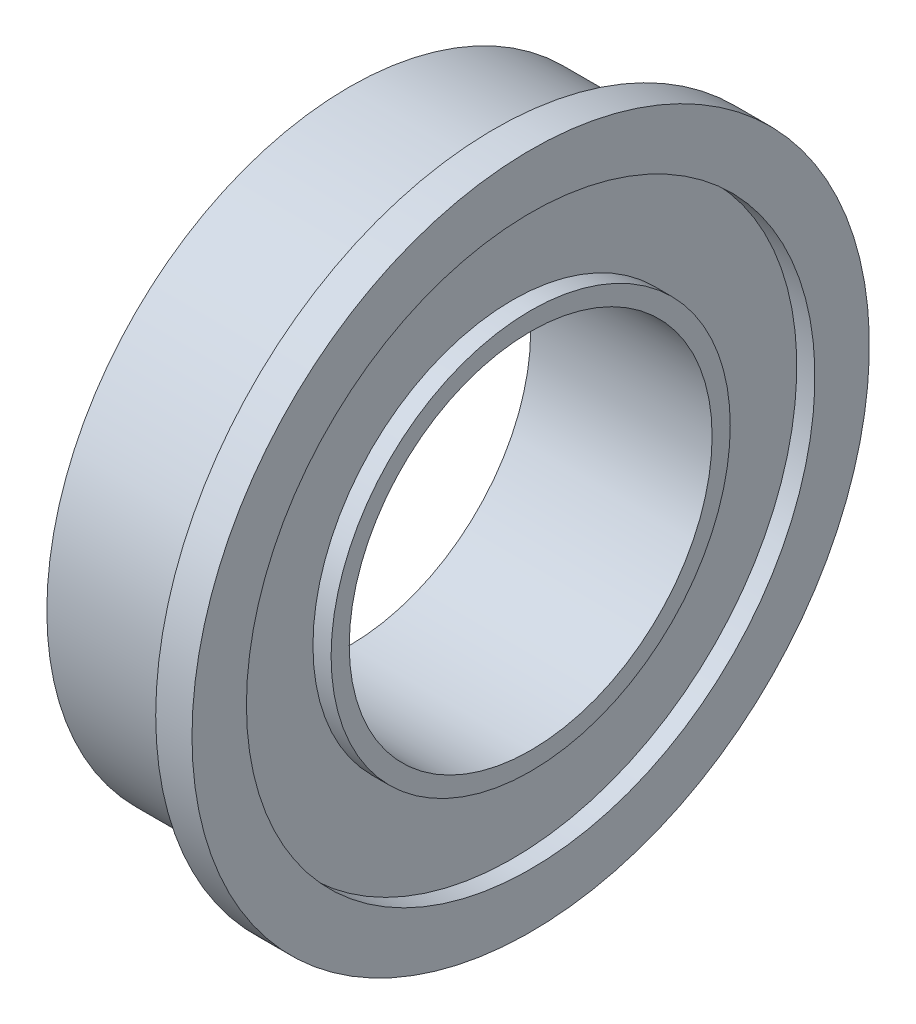
ISO-10303-21;
HEADER;
FILE_DESCRIPTION(('STEP AP214'),'2;1');
FILE_NAME('part.step','',(''),(''),'','','');
FILE_SCHEMA(('AUTOMOTIVE_DESIGN { 1 0 10303 214 1 1 1 1 }'));
ENDSEC;
DATA;
#1=APPLICATION_CONTEXT('core data for automotive mechanical design processes');
#2=APPLICATION_PROTOCOL_DEFINITION('international standard','automotive_design',2000,#1);
#3=PRODUCT_CONTEXT('',#1,'mechanical');
#4=PRODUCT('Part','Part','',(#3));
#5=PRODUCT_RELATED_PRODUCT_CATEGORY('part','',(#4));
#6=PRODUCT_DEFINITION_FORMATION('','',#4);
#7=PRODUCT_DEFINITION_CONTEXT('part definition',#1,'design');
#8=PRODUCT_DEFINITION('design','',#6,#7);
#9=PRODUCT_DEFINITION_SHAPE('','',#8);
#10=(LENGTH_UNIT() NAMED_UNIT(*) SI_UNIT(.MILLI.,.METRE.));
#11=(NAMED_UNIT(*) PLANE_ANGLE_UNIT() SI_UNIT($,.RADIAN.));
#12=(NAMED_UNIT(*) SI_UNIT($,.STERADIAN.) SOLID_ANGLE_UNIT());
#13=UNCERTAINTY_MEASURE_WITH_UNIT(LENGTH_MEASURE(1.E-05),#10,'distance_accuracy_value','');
#14=(GEOMETRIC_REPRESENTATION_CONTEXT(3) GLOBAL_UNCERTAINTY_ASSIGNED_CONTEXT((#13)) GLOBAL_UNIT_ASSIGNED_CONTEXT((#10,
#11,#12)) REPRESENTATION_CONTEXT('',''));
#15=CARTESIAN_POINT('',(0.,0.,0.));
#16=DIRECTION('',(0.,0.,1.));
#17=DIRECTION('',(1.,0.,0.));
#18=AXIS2_PLACEMENT_3D('',#15,#16,#17);
#19=CARTESIAN_POINT('',(-9.6317920181157,0.,0.));
#20=DIRECTION('',(-1.,0.,0.));
#21=DIRECTION('',(0.,0.,1.));
#22=AXIS2_PLACEMENT_3D('',#19,#20,#21);
#23=CYLINDRICAL_SURFACE('',#22,5.6);
#24=CARTESIAN_POINT('',(0.,0.,0.));
#25=DIRECTION('',(-1.,0.,0.));
#26=DIRECTION('',(0.,0.,1.));
#27=AXIS2_PLACEMENT_3D('',#24,#25,#26);
#28=CIRCLE('',#27,5.6);
#29=CARTESIAN_POINT('',(0.,0.,5.6));
#30=VERTEX_POINT('',#29);
#31=EDGE_CURVE('E75',#30,#30,#28,.T.);
#32=ORIENTED_EDGE('',*,*,#31,.F.);
#33=EDGE_LOOP('',(#32));
#34=FACE_BOUND('',#33,.T.);
#35=CARTESIAN_POINT('',(0.6,0.,0.));
#36=DIRECTION('',(-1.,0.,0.));
#37=DIRECTION('',(0.,0.,1.));
#38=AXIS2_PLACEMENT_3D('',#35,#36,#37);
#39=CIRCLE('',#38,5.6);
#40=CARTESIAN_POINT('',(0.6,0.,5.6));
#41=VERTEX_POINT('',#40);
#42=EDGE_CURVE('E10',#41,#41,#39,.T.);
#43=ORIENTED_EDGE('',*,*,#42,.T.);
#44=EDGE_LOOP('',(#43));
#45=FACE_BOUND('',#44,.T.);
#46=ADVANCED_FACE('F29',(#34,#45),#23,.T.);
#47=CARTESIAN_POINT('',(0.6,5.6,0.));
#48=DIRECTION('',(-1.,0.,0.));
#49=DIRECTION('',(0.,0.,1.));
#50=AXIS2_PLACEMENT_3D('',#47,#48,#49);
#51=PLANE('',#50);
#52=ORIENTED_EDGE('',*,*,#42,.F.);
#53=EDGE_LOOP('',(#52));
#54=FACE_BOUND('',#53,.T.);
#55=CARTESIAN_POINT('',(0.6,0.,0.));
#56=DIRECTION('',(-1.,0.,0.));
#57=DIRECTION('',(0.,0.,1.));
#58=AXIS2_PLACEMENT_3D('',#55,#56,#57);
#59=CIRCLE('',#58,4.7);
#60=CARTESIAN_POINT('',(0.6,0.,4.7));
#61=VERTEX_POINT('',#60);
#62=EDGE_CURVE('E35',#61,#61,#59,.T.);
#63=ORIENTED_EDGE('',*,*,#62,.T.);
#64=EDGE_LOOP('',(#63));
#65=FACE_BOUND('',#64,.T.);
#66=ADVANCED_FACE('F82',(#54,#65),#51,.F.);
#67=CARTESIAN_POINT('',(-9.6317920181157,0.,0.));
#68=DIRECTION('',(-1.,0.,0.));
#69=DIRECTION('',(0.,0.,1.));
#70=AXIS2_PLACEMENT_3D('',#67,#68,#69);
#71=CYLINDRICAL_SURFACE('',#70,4.7);
#72=ORIENTED_EDGE('',*,*,#62,.F.);
#73=EDGE_LOOP('',(#72));
#74=FACE_BOUND('',#73,.T.);
#75=CARTESIAN_POINT('',(0.3,0.,0.));
#76=DIRECTION('',(-1.,0.,0.));
#77=DIRECTION('',(0.,0.,1.));
#78=AXIS2_PLACEMENT_3D('',#75,#76,#77);
#79=CIRCLE('',#78,4.7);
#80=CARTESIAN_POINT('',(0.3,0.,4.7));
#81=VERTEX_POINT('',#80);
#82=EDGE_CURVE('E39',#81,#81,#79,.T.);
#83=ORIENTED_EDGE('',*,*,#82,.T.);
#84=EDGE_LOOP('',(#83));
#85=FACE_BOUND('',#84,.T.);
#86=ADVANCED_FACE('F86',(#74,#85),#71,.F.);
#87=CARTESIAN_POINT('',(0.3,4.7,0.));
#88=DIRECTION('',(-1.,0.,0.));
#89=DIRECTION('',(0.,0.,1.));
#90=AXIS2_PLACEMENT_3D('',#87,#88,#89);
#91=PLANE('',#90);
#92=ORIENTED_EDGE('',*,*,#82,.F.);
#93=EDGE_LOOP('',(#92));
#94=FACE_BOUND('',#93,.T.);
#95=CARTESIAN_POINT('',(0.3,0.,0.));
#96=DIRECTION('',(-1.,0.,0.));
#97=DIRECTION('',(0.,0.,1.));
#98=AXIS2_PLACEMENT_3D('',#95,#96,#97);
#99=CIRCLE('',#98,3.3);
#100=CARTESIAN_POINT('',(0.3,0.,3.3));
#101=VERTEX_POINT('',#100);
#102=EDGE_CURVE('E43',#101,#101,#99,.T.);
#103=ORIENTED_EDGE('',*,*,#102,.T.);
#104=EDGE_LOOP('',(#103));
#105=FACE_BOUND('',#104,.T.);
#106=ADVANCED_FACE('F91',(#94,#105),#91,.F.);
#107=CARTESIAN_POINT('',(-9.6317920181157,0.,0.));
#108=DIRECTION('',(-1.,0.,0.));
#109=DIRECTION('',(0.,0.,1.));
#110=AXIS2_PLACEMENT_3D('',#107,#108,#109);
#111=CYLINDRICAL_SURFACE('',#110,3.3);
#112=ORIENTED_EDGE('',*,*,#102,.F.);
#113=EDGE_LOOP('',(#112));
#114=FACE_BOUND('',#113,.T.);
#115=CARTESIAN_POINT('',(0.6,0.,0.));
#116=DIRECTION('',(-1.,0.,0.));
#117=DIRECTION('',(0.,0.,1.));
#118=AXIS2_PLACEMENT_3D('',#115,#116,#117);
#119=CIRCLE('',#118,3.3);
#120=CARTESIAN_POINT('',(0.6,0.,3.3));
#121=VERTEX_POINT('',#120);
#122=EDGE_CURVE('E48',#121,#121,#119,.T.);
#123=ORIENTED_EDGE('',*,*,#122,.T.);
#124=EDGE_LOOP('',(#123));
#125=FACE_BOUND('',#124,.T.);
#126=ADVANCED_FACE('F97',(#114,#125),#111,.T.);
#127=CARTESIAN_POINT('',(0.6,3.3,0.));
#128=DIRECTION('',(-1.,0.,0.));
#129=DIRECTION('',(0.,0.,1.));
#130=AXIS2_PLACEMENT_3D('',#127,#128,#129);
#131=PLANE('',#130);
#132=ORIENTED_EDGE('',*,*,#122,.F.);
#133=EDGE_LOOP('',(#132));
#134=FACE_BOUND('',#133,.T.);
#135=CARTESIAN_POINT('',(0.6,0.,0.));
#136=DIRECTION('',(-1.,0.,0.));
#137=DIRECTION('',(0.,0.,1.));
#138=AXIS2_PLACEMENT_3D('',#135,#136,#137);
#139=CIRCLE('',#138,3.);
#140=CARTESIAN_POINT('',(0.6,0.,3.));
#141=VERTEX_POINT('',#140);
#142=EDGE_CURVE('E51',#141,#141,#139,.T.);
#143=ORIENTED_EDGE('',*,*,#142,.T.);
#144=EDGE_LOOP('',(#143));
#145=FACE_BOUND('',#144,.T.);
#146=ADVANCED_FACE('F101',(#134,#145),#131,.F.);
#147=CARTESIAN_POINT('',(-9.6317920181157,0.,0.));
#148=DIRECTION('',(-1.,0.,0.));
#149=DIRECTION('',(0.,0.,1.));
#150=AXIS2_PLACEMENT_3D('',#147,#148,#149);
#151=CYLINDRICAL_SURFACE('',#150,3.);
#152=ORIENTED_EDGE('',*,*,#142,.F.);
#153=EDGE_LOOP('',(#152));
#154=FACE_BOUND('',#153,.T.);
#155=CARTESIAN_POINT('',(-2.4,0.,0.));
#156=DIRECTION('',(-1.,0.,0.));
#157=DIRECTION('',(0.,0.,1.));
#158=AXIS2_PLACEMENT_3D('',#155,#156,#157);
#159=CIRCLE('',#158,3.);
#160=CARTESIAN_POINT('',(-2.4,0.,3.));
#161=VERTEX_POINT('',#160);
#162=EDGE_CURVE('E54',#161,#161,#159,.T.);
#163=ORIENTED_EDGE('',*,*,#162,.T.);
#164=EDGE_LOOP('',(#163));
#165=FACE_BOUND('',#164,.T.);
#166=ADVANCED_FACE('F105',(#154,#165),#151,.F.);
#167=CARTESIAN_POINT('',(-2.4,3.,0.));
#168=DIRECTION('',(1.,0.,0.));
#169=DIRECTION('',(0.,0.,-1.));
#170=AXIS2_PLACEMENT_3D('',#167,#168,#169);
#171=PLANE('',#170);
#172=ORIENTED_EDGE('',*,*,#162,.F.);
#173=EDGE_LOOP('',(#172));
#174=FACE_BOUND('',#173,.T.);
#175=CARTESIAN_POINT('',(-2.4,0.,0.));
#176=DIRECTION('',(-1.,0.,0.));
#177=DIRECTION('',(0.,0.,1.));
#178=AXIS2_PLACEMENT_3D('',#175,#176,#177);
#179=CIRCLE('',#178,3.3);
#180=CARTESIAN_POINT('',(-2.4,0.,3.3));
#181=VERTEX_POINT('',#180);
#182=EDGE_CURVE('E57',#181,#181,#179,.T.);
#183=ORIENTED_EDGE('',*,*,#182,.T.);
#184=EDGE_LOOP('',(#183));
#185=FACE_BOUND('',#184,.T.);
#186=ADVANCED_FACE('F109',(#174,#185),#171,.F.);
#187=CARTESIAN_POINT('',(-9.6317920181157,0.,0.));
#188=DIRECTION('',(-1.,0.,0.));
#189=DIRECTION('',(0.,0.,1.));
#190=AXIS2_PLACEMENT_3D('',#187,#188,#189);
#191=CYLINDRICAL_SURFACE('',#190,3.3);
#192=ORIENTED_EDGE('',*,*,#182,.F.);
#193=EDGE_LOOP('',(#192));
#194=FACE_BOUND('',#193,.T.);
#195=CARTESIAN_POINT('',(-2.1,0.,0.));
#196=DIRECTION('',(-1.,0.,0.));
#197=DIRECTION('',(0.,0.,1.));
#198=AXIS2_PLACEMENT_3D('',#195,#196,#197);
#199=CIRCLE('',#198,3.3);
#200=CARTESIAN_POINT('',(-2.1,0.,3.3));
#201=VERTEX_POINT('',#200);
#202=EDGE_CURVE('E60',#201,#201,#199,.T.);
#203=ORIENTED_EDGE('',*,*,#202,.T.);
#204=EDGE_LOOP('',(#203));
#205=FACE_BOUND('',#204,.T.);
#206=ADVANCED_FACE('F113',(#194,#205),#191,.T.);
#207=CARTESIAN_POINT('',(-2.1,4.7,0.));
#208=DIRECTION('',(1.,0.,0.));
#209=DIRECTION('',(0.,0.,-1.));
#210=AXIS2_PLACEMENT_3D('',#207,#208,#209);
#211=PLANE('',#210);
#212=ORIENTED_EDGE('',*,*,#202,.F.);
#213=EDGE_LOOP('',(#212));
#214=FACE_BOUND('',#213,.T.);
#215=CARTESIAN_POINT('',(-2.1,0.,0.));
#216=DIRECTION('',(-1.,0.,0.));
#217=DIRECTION('',(0.,0.,1.));
#218=AXIS2_PLACEMENT_3D('',#215,#216,#217);
#219=CIRCLE('',#218,4.7);
#220=CARTESIAN_POINT('',(-2.1,0.,4.7));
#221=VERTEX_POINT('',#220);
#222=EDGE_CURVE('E63',#221,#221,#219,.T.);
#223=ORIENTED_EDGE('',*,*,#222,.T.);
#224=EDGE_LOOP('',(#223));
#225=FACE_BOUND('',#224,.T.);
#226=ADVANCED_FACE('F117',(#214,#225),#211,.F.);
#227=CARTESIAN_POINT('',(-9.6317920181157,0.,0.));
#228=DIRECTION('',(-1.,0.,0.));
#229=DIRECTION('',(0.,0.,1.));
#230=AXIS2_PLACEMENT_3D('',#227,#228,#229);
#231=CYLINDRICAL_SURFACE('',#230,4.7);
#232=ORIENTED_EDGE('',*,*,#222,.F.);
#233=EDGE_LOOP('',(#232));
#234=FACE_BOUND('',#233,.T.);
#235=CARTESIAN_POINT('',(-2.4,0.,0.));
#236=DIRECTION('',(-1.,0.,0.));
#237=DIRECTION('',(0.,0.,1.));
#238=AXIS2_PLACEMENT_3D('',#235,#236,#237);
#239=CIRCLE('',#238,4.7);
#240=CARTESIAN_POINT('',(-2.4,0.,4.7));
#241=VERTEX_POINT('',#240);
#242=EDGE_CURVE('E66',#241,#241,#239,.T.);
#243=ORIENTED_EDGE('',*,*,#242,.T.);
#244=EDGE_LOOP('',(#243));
#245=FACE_BOUND('',#244,.T.);
#246=ADVANCED_FACE('F121',(#234,#245),#231,.F.);
#247=CARTESIAN_POINT('',(-2.4,4.7,0.));
#248=DIRECTION('',(1.,0.,0.));
#249=DIRECTION('',(0.,0.,-1.));
#250=AXIS2_PLACEMENT_3D('',#247,#248,#249);
#251=PLANE('',#250);
#252=ORIENTED_EDGE('',*,*,#242,.F.);
#253=EDGE_LOOP('',(#252));
#254=FACE_BOUND('',#253,.T.);
#255=CARTESIAN_POINT('',(-2.4,0.,0.));
#256=DIRECTION('',(-1.,0.,0.));
#257=DIRECTION('',(0.,0.,1.));
#258=AXIS2_PLACEMENT_3D('',#255,#256,#257);
#259=CIRCLE('',#258,5.);
#260=CARTESIAN_POINT('',(-2.4,0.,5.));
#261=VERTEX_POINT('',#260);
#262=EDGE_CURVE('E69',#261,#261,#259,.T.);
#263=ORIENTED_EDGE('',*,*,#262,.T.);
#264=EDGE_LOOP('',(#263));
#265=FACE_BOUND('',#264,.T.);
#266=ADVANCED_FACE('F125',(#254,#265),#251,.F.);
#267=CARTESIAN_POINT('',(-9.6317920181157,0.,0.));
#268=DIRECTION('',(-1.,0.,0.));
#269=DIRECTION('',(0.,0.,1.));
#270=AXIS2_PLACEMENT_3D('',#267,#268,#269);
#271=CYLINDRICAL_SURFACE('',#270,5.);
#272=ORIENTED_EDGE('',*,*,#262,.F.);
#273=EDGE_LOOP('',(#272));
#274=FACE_BOUND('',#273,.T.);
#275=CARTESIAN_POINT('',(0.,0.,0.));
#276=DIRECTION('',(-1.,0.,0.));
#277=DIRECTION('',(0.,0.,1.));
#278=AXIS2_PLACEMENT_3D('',#275,#276,#277);
#279=CIRCLE('',#278,5.);
#280=CARTESIAN_POINT('',(0.,0.,5.));
#281=VERTEX_POINT('',#280);
#282=EDGE_CURVE('E72',#281,#281,#279,.T.);
#283=ORIENTED_EDGE('',*,*,#282,.T.);
#284=EDGE_LOOP('',(#283));
#285=FACE_BOUND('',#284,.T.);
#286=ADVANCED_FACE('F129',(#274,#285),#271,.T.);
#287=CARTESIAN_POINT('',(0.,5.6,0.));
#288=DIRECTION('',(1.,0.,0.));
#289=DIRECTION('',(0.,0.,-1.));
#290=AXIS2_PLACEMENT_3D('',#287,#288,#289);
#291=PLANE('',#290);
#292=ORIENTED_EDGE('',*,*,#282,.F.);
#293=EDGE_LOOP('',(#292));
#294=FACE_BOUND('',#293,.T.);
#295=ORIENTED_EDGE('',*,*,#31,.T.);
#296=EDGE_LOOP('',(#295));
#297=FACE_BOUND('',#296,.T.);
#298=ADVANCED_FACE('F79',(#294,#297),#291,.F.);
#299=CLOSED_SHELL('',(#46,#66,#86,#106,#126,#146,#166,#186,#206,#226,#246,#266,#286,#298));
#300=MANIFOLD_SOLID_BREP('B2',#299);
#301=ADVANCED_BREP_SHAPE_REPRESENTATION('',(#18,#300),#14);
#302=SHAPE_DEFINITION_REPRESENTATION(#9,#301);
ENDSEC;
END-ISO-10303-21;
